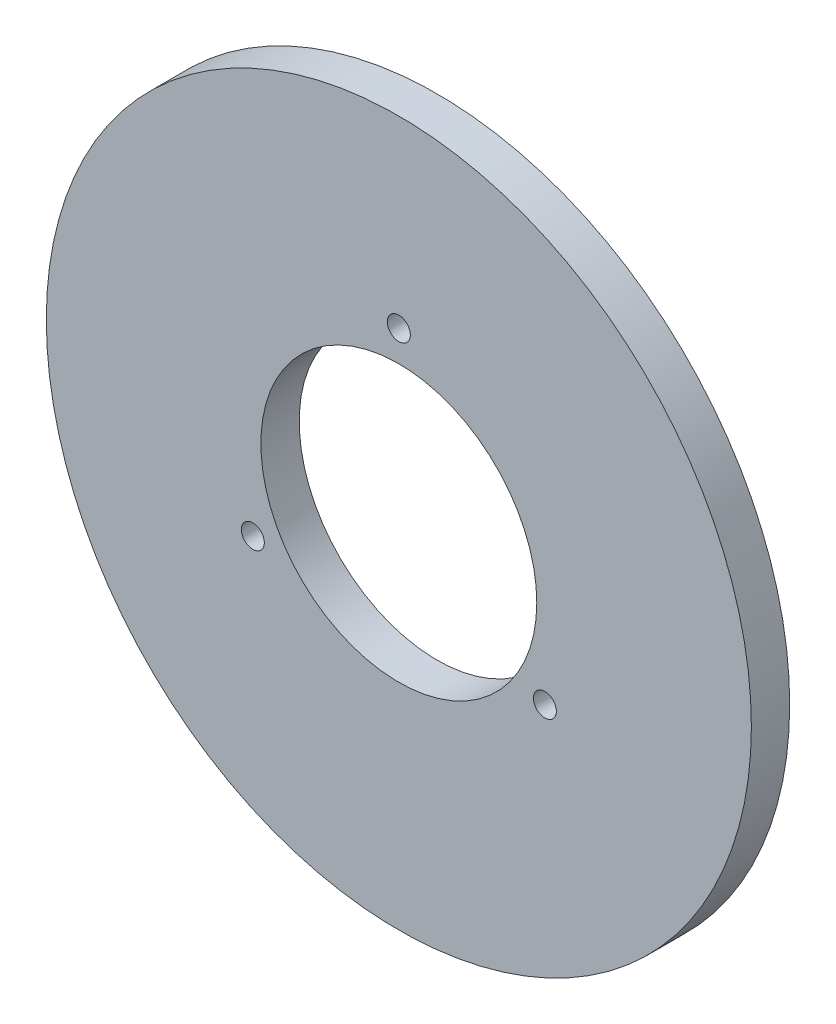
ISO-10303-21;
HEADER;
FILE_DESCRIPTION(('STEP AP214'),'2;1');
FILE_NAME('part.step','',(''),(''),'','','');
FILE_SCHEMA(('AUTOMOTIVE_DESIGN { 1 0 10303 214 1 1 1 1 }'));
ENDSEC;
DATA;
#1=APPLICATION_CONTEXT('core data for automotive mechanical design processes');
#2=APPLICATION_PROTOCOL_DEFINITION('international standard','automotive_design',2000,#1);
#3=PRODUCT_CONTEXT('',#1,'mechanical');
#4=PRODUCT('Part','Part','',(#3));
#5=PRODUCT_RELATED_PRODUCT_CATEGORY('part','',(#4));
#6=PRODUCT_DEFINITION_FORMATION('','',#4);
#7=PRODUCT_DEFINITION_CONTEXT('part definition',#1,'design');
#8=PRODUCT_DEFINITION('design','',#6,#7);
#9=PRODUCT_DEFINITION_SHAPE('','',#8);
#10=(LENGTH_UNIT() NAMED_UNIT(*) SI_UNIT(.MILLI.,.METRE.));
#11=(NAMED_UNIT(*) PLANE_ANGLE_UNIT() SI_UNIT($,.RADIAN.));
#12=(NAMED_UNIT(*) SI_UNIT($,.STERADIAN.) SOLID_ANGLE_UNIT());
#13=UNCERTAINTY_MEASURE_WITH_UNIT(LENGTH_MEASURE(1.E-05),#10,'distance_accuracy_value','');
#14=(GEOMETRIC_REPRESENTATION_CONTEXT(3) GLOBAL_UNCERTAINTY_ASSIGNED_CONTEXT((#13)) GLOBAL_UNIT_ASSIGNED_CONTEXT((#10,
#11,#12)) REPRESENTATION_CONTEXT('',''));
#15=CARTESIAN_POINT('',(0.,0.,0.));
#16=DIRECTION('',(0.,0.,1.));
#17=DIRECTION('',(1.,0.,0.));
#18=AXIS2_PLACEMENT_3D('',#15,#16,#17);
#19=CARTESIAN_POINT('',(0.,0.,5.));
#20=DIRECTION('',(0.,0.,1.));
#21=DIRECTION('',(1.,0.,0.));
#22=AXIS2_PLACEMENT_3D('',#19,#20,#21);
#23=PLANE('',#22);
#24=CARTESIAN_POINT('',(0.,22.,5.));
#25=DIRECTION('',(0.,0.,-1.));
#26=DIRECTION('',(-1.,0.,0.));
#27=AXIS2_PLACEMENT_3D('',#24,#25,#26);
#28=CIRCLE('',#27,1.5);
#29=CARTESIAN_POINT('',(-1.5,22.,5.));
#30=VERTEX_POINT('',#29);
#31=EDGE_CURVE('E59',#30,#30,#28,.T.);
#32=ORIENTED_EDGE('',*,*,#31,.T.);
#33=EDGE_LOOP('',(#32));
#34=FACE_BOUND('',#33,.T.);
#35=CARTESIAN_POINT('',(-19.0525588832577,-11.,5.));
#36=DIRECTION('',(0.,0.,-1.));
#37=DIRECTION('',(-1.,0.,0.));
#38=AXIS2_PLACEMENT_3D('',#35,#36,#37);
#39=CIRCLE('',#38,1.5);
#40=CARTESIAN_POINT('',(-20.5525588832577,-11.,5.));
#41=VERTEX_POINT('',#40);
#42=EDGE_CURVE('E76',#41,#41,#39,.T.);
#43=ORIENTED_EDGE('',*,*,#42,.T.);
#44=EDGE_LOOP('',(#43));
#45=FACE_BOUND('',#44,.T.);
#46=CARTESIAN_POINT('',(19.0525588832576,-11.,5.));
#47=DIRECTION('',(0.,0.,-1.));
#48=DIRECTION('',(-1.,0.,0.));
#49=AXIS2_PLACEMENT_3D('',#46,#47,#48);
#50=CIRCLE('',#49,1.5);
#51=CARTESIAN_POINT('',(17.5525588832576,-11.,5.));
#52=VERTEX_POINT('',#51);
#53=EDGE_CURVE('E73',#52,#52,#50,.T.);
#54=ORIENTED_EDGE('',*,*,#53,.T.);
#55=EDGE_LOOP('',(#54));
#56=FACE_BOUND('',#55,.T.);
#57=CARTESIAN_POINT('',(0.,0.,5.));
#58=DIRECTION('',(0.,0.,1.));
#59=DIRECTION('',(1.,0.,0.));
#60=AXIS2_PLACEMENT_3D('',#57,#58,#59);
#61=CIRCLE('',#60,46.);
#62=CARTESIAN_POINT('',(46.,0.,5.));
#63=VERTEX_POINT('',#62);
#64=EDGE_CURVE('E10',#63,#63,#61,.T.);
#65=ORIENTED_EDGE('',*,*,#64,.T.);
#66=EDGE_LOOP('',(#65));
#67=FACE_BOUND('',#66,.T.);
#68=CARTESIAN_POINT('',(0.,0.,5.));
#69=DIRECTION('',(0.,0.,1.));
#70=DIRECTION('',(1.,0.,0.));
#71=AXIS2_PLACEMENT_3D('',#68,#69,#70);
#72=CIRCLE('',#71,18.);
#73=CARTESIAN_POINT('',(18.,0.,5.));
#74=VERTEX_POINT('',#73);
#75=EDGE_CURVE('E50',#74,#74,#72,.T.);
#76=ORIENTED_EDGE('',*,*,#75,.F.);
#77=EDGE_LOOP('',(#76));
#78=FACE_BOUND('',#77,.T.);
#79=ADVANCED_FACE('F37',(#34,#45,#56,#67,#78),#23,.T.);
#80=CARTESIAN_POINT('',(0.,0.,0.));
#81=DIRECTION('',(0.,0.,1.));
#82=DIRECTION('',(1.,0.,0.));
#83=AXIS2_PLACEMENT_3D('',#80,#81,#82);
#84=PLANE('',#83);
#85=CARTESIAN_POINT('',(0.,22.,0.));
#86=DIRECTION('',(0.,0.,1.));
#87=DIRECTION('',(1.,0.,0.));
#88=AXIS2_PLACEMENT_3D('',#85,#86,#87);
#89=CIRCLE('',#88,1.5);
#90=CARTESIAN_POINT('',(1.5,22.,0.));
#91=VERTEX_POINT('',#90);
#92=EDGE_CURVE('E41',#91,#91,#89,.T.);
#93=ORIENTED_EDGE('',*,*,#92,.T.);
#94=EDGE_LOOP('',(#93));
#95=FACE_BOUND('',#94,.T.);
#96=CARTESIAN_POINT('',(-19.0525588832577,-11.,0.));
#97=DIRECTION('',(0.,0.,1.));
#98=DIRECTION('',(1.,0.,0.));
#99=AXIS2_PLACEMENT_3D('',#96,#97,#98);
#100=CIRCLE('',#99,1.5);
#101=CARTESIAN_POINT('',(-17.5525588832577,-11.,0.));
#102=VERTEX_POINT('',#101);
#103=EDGE_CURVE('E58',#102,#102,#100,.T.);
#104=ORIENTED_EDGE('',*,*,#103,.T.);
#105=EDGE_LOOP('',(#104));
#106=FACE_BOUND('',#105,.T.);
#107=CARTESIAN_POINT('',(19.0525588832576,-11.,0.));
#108=DIRECTION('',(0.,0.,1.));
#109=DIRECTION('',(1.,0.,0.));
#110=AXIS2_PLACEMENT_3D('',#107,#108,#109);
#111=CIRCLE('',#110,1.5);
#112=CARTESIAN_POINT('',(20.5525588832576,-11.,0.));
#113=VERTEX_POINT('',#112);
#114=EDGE_CURVE('E56',#113,#113,#111,.T.);
#115=ORIENTED_EDGE('',*,*,#114,.T.);
#116=EDGE_LOOP('',(#115));
#117=FACE_BOUND('',#116,.T.);
#118=CARTESIAN_POINT('',(0.,0.,0.));
#119=DIRECTION('',(0.,0.,1.));
#120=DIRECTION('',(1.,0.,0.));
#121=AXIS2_PLACEMENT_3D('',#118,#119,#120);
#122=CIRCLE('',#121,46.);
#123=CARTESIAN_POINT('',(46.,0.,0.));
#124=VERTEX_POINT('',#123);
#125=EDGE_CURVE('E45',#124,#124,#122,.T.);
#126=ORIENTED_EDGE('',*,*,#125,.F.);
#127=EDGE_LOOP('',(#126));
#128=FACE_BOUND('',#127,.T.);
#129=CARTESIAN_POINT('',(0.,0.,0.));
#130=DIRECTION('',(0.,0.,1.));
#131=DIRECTION('',(1.,0.,0.));
#132=AXIS2_PLACEMENT_3D('',#129,#130,#131);
#133=CIRCLE('',#132,18.);
#134=CARTESIAN_POINT('',(18.,0.,0.));
#135=VERTEX_POINT('',#134);
#136=EDGE_CURVE('E53',#135,#135,#133,.T.);
#137=ORIENTED_EDGE('',*,*,#136,.T.);
#138=EDGE_LOOP('',(#137));
#139=FACE_BOUND('',#138,.T.);
#140=ADVANCED_FACE('F96',(#95,#106,#117,#128,#139),#84,.F.);
#141=CARTESIAN_POINT('',(0.,0.,5.));
#142=DIRECTION('',(0.,0.,-1.));
#143=DIRECTION('',(-1.,0.,0.));
#144=AXIS2_PLACEMENT_3D('',#141,#142,#143);
#145=CYLINDRICAL_SURFACE('',#144,46.);
#146=ORIENTED_EDGE('',*,*,#64,.F.);
#147=EDGE_LOOP('',(#146));
#148=FACE_BOUND('',#147,.T.);
#149=ORIENTED_EDGE('',*,*,#125,.T.);
#150=EDGE_LOOP('',(#149));
#151=FACE_BOUND('',#150,.T.);
#152=ADVANCED_FACE('F39',(#148,#151),#145,.T.);
#153=CARTESIAN_POINT('',(0.,0.,5.));
#154=DIRECTION('',(0.,0.,-1.));
#155=DIRECTION('',(-1.,0.,0.));
#156=AXIS2_PLACEMENT_3D('',#153,#154,#155);
#157=CYLINDRICAL_SURFACE('',#156,18.);
#158=ORIENTED_EDGE('',*,*,#75,.T.);
#159=EDGE_LOOP('',(#158));
#160=FACE_BOUND('',#159,.T.);
#161=ORIENTED_EDGE('',*,*,#136,.F.);
#162=EDGE_LOOP('',(#161));
#163=FACE_BOUND('',#162,.T.);
#164=ADVANCED_FACE('F102',(#160,#163),#157,.F.);
#165=CARTESIAN_POINT('',(19.0525588832576,-11.,5.));
#166=DIRECTION('',(0.,0.,-1.));
#167=DIRECTION('',(-1.,0.,0.));
#168=AXIS2_PLACEMENT_3D('',#165,#166,#167);
#169=CYLINDRICAL_SURFACE('',#168,1.5);
#170=ORIENTED_EDGE('',*,*,#53,.F.);
#171=EDGE_LOOP('',(#170));
#172=FACE_BOUND('',#171,.T.);
#173=ORIENTED_EDGE('',*,*,#114,.F.);
#174=EDGE_LOOP('',(#173));
#175=FACE_BOUND('',#174,.T.);
#176=ADVANCED_FACE('F92',(#172,#175),#169,.F.);
#177=CARTESIAN_POINT('',(-19.0525588832577,-11.,5.));
#178=DIRECTION('',(0.,0.,-1.));
#179=DIRECTION('',(-1.,0.,0.));
#180=AXIS2_PLACEMENT_3D('',#177,#178,#179);
#181=CYLINDRICAL_SURFACE('',#180,1.5);
#182=ORIENTED_EDGE('',*,*,#42,.F.);
#183=EDGE_LOOP('',(#182));
#184=FACE_BOUND('',#183,.T.);
#185=ORIENTED_EDGE('',*,*,#103,.F.);
#186=EDGE_LOOP('',(#185));
#187=FACE_BOUND('',#186,.T.);
#188=ADVANCED_FACE('F87',(#184,#187),#181,.F.);
#189=CARTESIAN_POINT('',(0.,22.,5.));
#190=DIRECTION('',(0.,0.,-1.));
#191=DIRECTION('',(-1.,0.,0.));
#192=AXIS2_PLACEMENT_3D('',#189,#190,#191);
#193=CYLINDRICAL_SURFACE('',#192,1.5);
#194=ORIENTED_EDGE('',*,*,#31,.F.);
#195=EDGE_LOOP('',(#194));
#196=FACE_BOUND('',#195,.T.);
#197=ORIENTED_EDGE('',*,*,#92,.F.);
#198=EDGE_LOOP('',(#197));
#199=FACE_BOUND('',#198,.T.);
#200=ADVANCED_FACE('F84',(#196,#199),#193,.F.);
#201=CLOSED_SHELL('',(#79,#140,#152,#164,#176,#188,#200));
#202=MANIFOLD_SOLID_BREP('B2',#201);
#203=ADVANCED_BREP_SHAPE_REPRESENTATION('',(#18,#202),#14);
#204=SHAPE_DEFINITION_REPRESENTATION(#9,#203);
ENDSEC;
END-ISO-10303-21;
